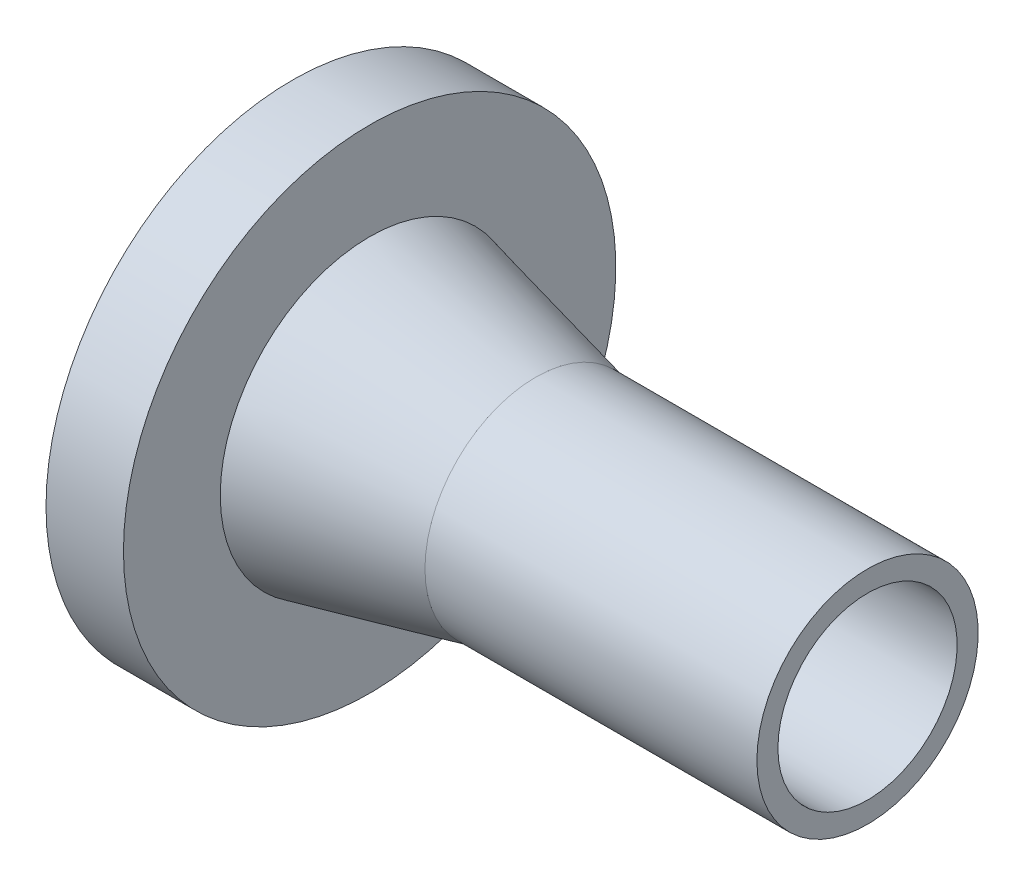
ISO-10303-21;
HEADER;
FILE_DESCRIPTION(('STEP AP214'),'2;1');
FILE_NAME('part.step','',(''),(''),'','','');
FILE_SCHEMA(('AUTOMOTIVE_DESIGN { 1 0 10303 214 1 1 1 1 }'));
ENDSEC;
DATA;
#1=APPLICATION_CONTEXT('core data for automotive mechanical design processes');
#2=APPLICATION_PROTOCOL_DEFINITION('international standard','automotive_design',2000,#1);
#3=PRODUCT_CONTEXT('',#1,'mechanical');
#4=PRODUCT('Part','Part','',(#3));
#5=PRODUCT_RELATED_PRODUCT_CATEGORY('part','',(#4));
#6=PRODUCT_DEFINITION_FORMATION('','',#4);
#7=PRODUCT_DEFINITION_CONTEXT('part definition',#1,'design');
#8=PRODUCT_DEFINITION('design','',#6,#7);
#9=PRODUCT_DEFINITION_SHAPE('','',#8);
#10=(LENGTH_UNIT() NAMED_UNIT(*) SI_UNIT(.MILLI.,.METRE.));
#11=(NAMED_UNIT(*) PLANE_ANGLE_UNIT() SI_UNIT($,.RADIAN.));
#12=(NAMED_UNIT(*) SI_UNIT($,.STERADIAN.) SOLID_ANGLE_UNIT());
#13=UNCERTAINTY_MEASURE_WITH_UNIT(LENGTH_MEASURE(1.E-05),#10,'distance_accuracy_value','');
#14=(GEOMETRIC_REPRESENTATION_CONTEXT(3) GLOBAL_UNCERTAINTY_ASSIGNED_CONTEXT((#13)) GLOBAL_UNIT_ASSIGNED_CONTEXT((#10,
#11,#12)) REPRESENTATION_CONTEXT('',''));
#15=CARTESIAN_POINT('',(0.,0.,0.));
#16=DIRECTION('',(0.,0.,1.));
#17=DIRECTION('',(1.,0.,0.));
#18=AXIS2_PLACEMENT_3D('',#15,#16,#17);
#19=CARTESIAN_POINT('',(-30.,0.,0.));
#20=DIRECTION('',(-1.,0.,0.));
#21=DIRECTION('',(0.,0.,1.));
#22=AXIS2_PLACEMENT_3D('',#19,#20,#21);
#23=CONICAL_SURFACE('',#22,10.,0.229231933276995);
#24=CARTESIAN_POINT('',(-45.,0.,0.));
#25=DIRECTION('',(-1.,0.,0.));
#26=DIRECTION('',(0.,0.,1.));
#27=AXIS2_PLACEMENT_3D('',#24,#25,#26);
#28=CIRCLE('',#27,13.5);
#29=CARTESIAN_POINT('',(-45.,0.,13.5));
#30=VERTEX_POINT('',#29);
#31=EDGE_CURVE('E16',#30,#30,#28,.T.);
#32=ORIENTED_EDGE('',*,*,#31,.F.);
#33=EDGE_LOOP('',(#32));
#34=FACE_BOUND('',#33,.T.);
#35=CARTESIAN_POINT('',(-30.,0.,0.));
#36=DIRECTION('',(-1.,0.,0.));
#37=DIRECTION('',(0.,1.,0.));
#38=AXIS2_PLACEMENT_3D('',#35,#36,#37);
#39=CIRCLE('',#38,10.);
#40=CARTESIAN_POINT('',(-30.,10.,0.));
#41=VERTEX_POINT('',#40);
#42=EDGE_CURVE('E28',#41,#41,#39,.F.);
#43=ORIENTED_EDGE('',*,*,#42,.F.);
#44=EDGE_LOOP('',(#43));
#45=FACE_BOUND('',#44,.T.);
#46=ADVANCED_FACE('F13',(#34,#45),#23,.T.);
#47=CARTESIAN_POINT('',(-45.,22.25,22.5170021084504));
#48=DIRECTION('',(1.,0.,0.));
#49=DIRECTION('',(0.,-1.,0.));
#50=AXIS2_PLACEMENT_3D('',#47,#48,#49);
#51=PLANE('',#50);
#52=ORIENTED_EDGE('',*,*,#31,.T.);
#53=EDGE_LOOP('',(#52));
#54=FACE_BOUND('',#53,.T.);
#55=CARTESIAN_POINT('',(-45.,0.,0.));
#56=DIRECTION('',(-1.,0.,0.));
#57=DIRECTION('',(0.,0.,1.));
#58=AXIS2_PLACEMENT_3D('',#55,#56,#57);
#59=CIRCLE('',#58,22.25);
#60=CARTESIAN_POINT('',(-45.,0.,22.25));
#61=VERTEX_POINT('',#60);
#62=EDGE_CURVE('E34',#61,#61,#59,.T.);
#63=ORIENTED_EDGE('',*,*,#62,.F.);
#64=EDGE_LOOP('',(#63));
#65=FACE_BOUND('',#64,.T.);
#66=ADVANCED_FACE('F44',(#54,#65),#51,.T.);
#67=CARTESIAN_POINT('',(-30.,0.,0.));
#68=DIRECTION('',(-1.,0.,0.));
#69=DIRECTION('',(0.,0.,1.));
#70=AXIS2_PLACEMENT_3D('',#67,#68,#69);
#71=CYLINDRICAL_SURFACE('',#70,10.);
#72=ORIENTED_EDGE('',*,*,#42,.T.);
#73=EDGE_LOOP('',(#72));
#74=FACE_BOUND('',#73,.T.);
#75=CARTESIAN_POINT('',(0.,0.,0.));
#76=DIRECTION('',(-1.,0.,0.));
#77=DIRECTION('',(0.,0.,1.));
#78=AXIS2_PLACEMENT_3D('',#75,#76,#77);
#79=CIRCLE('',#78,10.);
#80=CARTESIAN_POINT('',(0.,0.,10.));
#81=VERTEX_POINT('',#80);
#82=EDGE_CURVE('E32',#81,#81,#79,.F.);
#83=ORIENTED_EDGE('',*,*,#82,.F.);
#84=EDGE_LOOP('',(#83));
#85=FACE_BOUND('',#84,.T.);
#86=ADVANCED_FACE('F53',(#74,#85),#71,.T.);
#87=CARTESIAN_POINT('',(-52.,0.,0.));
#88=DIRECTION('',(-1.,0.,0.));
#89=DIRECTION('',(0.,0.,1.));
#90=AXIS2_PLACEMENT_3D('',#87,#88,#89);
#91=CYLINDRICAL_SURFACE('',#90,22.25);
#92=CARTESIAN_POINT('',(-52.,0.,0.));
#93=DIRECTION('',(-1.,0.,0.));
#94=DIRECTION('',(0.,0.,1.));
#95=AXIS2_PLACEMENT_3D('',#92,#93,#94);
#96=CIRCLE('',#95,22.25);
#97=CARTESIAN_POINT('',(-52.,0.,22.25));
#98=VERTEX_POINT('',#97);
#99=EDGE_CURVE('E25',#98,#98,#96,.T.);
#100=ORIENTED_EDGE('',*,*,#99,.F.);
#101=EDGE_LOOP('',(#100));
#102=FACE_BOUND('',#101,.T.);
#103=ORIENTED_EDGE('',*,*,#62,.T.);
#104=EDGE_LOOP('',(#103));
#105=FACE_BOUND('',#104,.T.);
#106=ADVANCED_FACE('F68',(#102,#105),#91,.T.);
#107=CARTESIAN_POINT('',(0.,10.,10.1200021082709));
#108=DIRECTION('',(1.,0.,0.));
#109=DIRECTION('',(0.,-1.,0.));
#110=AXIS2_PLACEMENT_3D('',#107,#108,#109);
#111=PLANE('',#110);
#112=CARTESIAN_POINT('',(0.,0.,0.));
#113=DIRECTION('',(-1.,0.,0.));
#114=DIRECTION('',(0.,0.,1.));
#115=AXIS2_PLACEMENT_3D('',#112,#113,#114);
#116=CIRCLE('',#115,8.10000000000001);
#117=CARTESIAN_POINT('',(0.,0.,8.10000000000001));
#118=VERTEX_POINT('',#117);
#119=EDGE_CURVE('E20',#118,#118,#116,.F.);
#120=ORIENTED_EDGE('',*,*,#119,.F.);
#121=EDGE_LOOP('',(#120));
#122=FACE_BOUND('',#121,.T.);
#123=ORIENTED_EDGE('',*,*,#82,.T.);
#124=EDGE_LOOP('',(#123));
#125=FACE_BOUND('',#124,.T.);
#126=ADVANCED_FACE('F62',(#122,#125),#111,.T.);
#127=CARTESIAN_POINT('',(-52.,-22.25,22.5170021083776));
#128=DIRECTION('',(-1.,0.,0.));
#129=DIRECTION('',(0.,1.,0.));
#130=AXIS2_PLACEMENT_3D('',#127,#128,#129);
#131=PLANE('',#130);
#132=CARTESIAN_POINT('',(-52.,0.,0.));
#133=DIRECTION('',(-1.,0.,0.));
#134=DIRECTION('',(0.,0.,1.));
#135=AXIS2_PLACEMENT_3D('',#132,#133,#134);
#136=CIRCLE('',#135,8.10000000000001);
#137=CARTESIAN_POINT('',(-52.,0.,8.10000000000001));
#138=VERTEX_POINT('',#137);
#139=EDGE_CURVE('E8',#138,#138,#136,.T.);
#140=ORIENTED_EDGE('',*,*,#139,.F.);
#141=EDGE_LOOP('',(#140));
#142=FACE_BOUND('',#141,.T.);
#143=ORIENTED_EDGE('',*,*,#99,.T.);
#144=EDGE_LOOP('',(#143));
#145=FACE_BOUND('',#144,.T.);
#146=ADVANCED_FACE('F56',(#142,#145),#131,.T.);
#147=CARTESIAN_POINT('',(0.,0.,0.));
#148=DIRECTION('',(-1.,0.,0.));
#149=DIRECTION('',(0.,0.,1.));
#150=AXIS2_PLACEMENT_3D('',#147,#148,#149);
#151=CYLINDRICAL_SURFACE('',#150,8.10000000000001);
#152=ORIENTED_EDGE('',*,*,#119,.T.);
#153=EDGE_LOOP('',(#152));
#154=FACE_BOUND('',#153,.T.);
#155=ORIENTED_EDGE('',*,*,#139,.T.);
#156=EDGE_LOOP('',(#155));
#157=FACE_BOUND('',#156,.T.);
#158=ADVANCED_FACE('F54',(#154,#157),#151,.F.);
#159=CLOSED_SHELL('',(#46,#66,#86,#106,#126,#146,#158));
#160=MANIFOLD_SOLID_BREP('B1',#159);
#161=ADVANCED_BREP_SHAPE_REPRESENTATION('',(#18,#160),#14);
#162=SHAPE_DEFINITION_REPRESENTATION(#9,#161);
ENDSEC;
END-ISO-10303-21;
